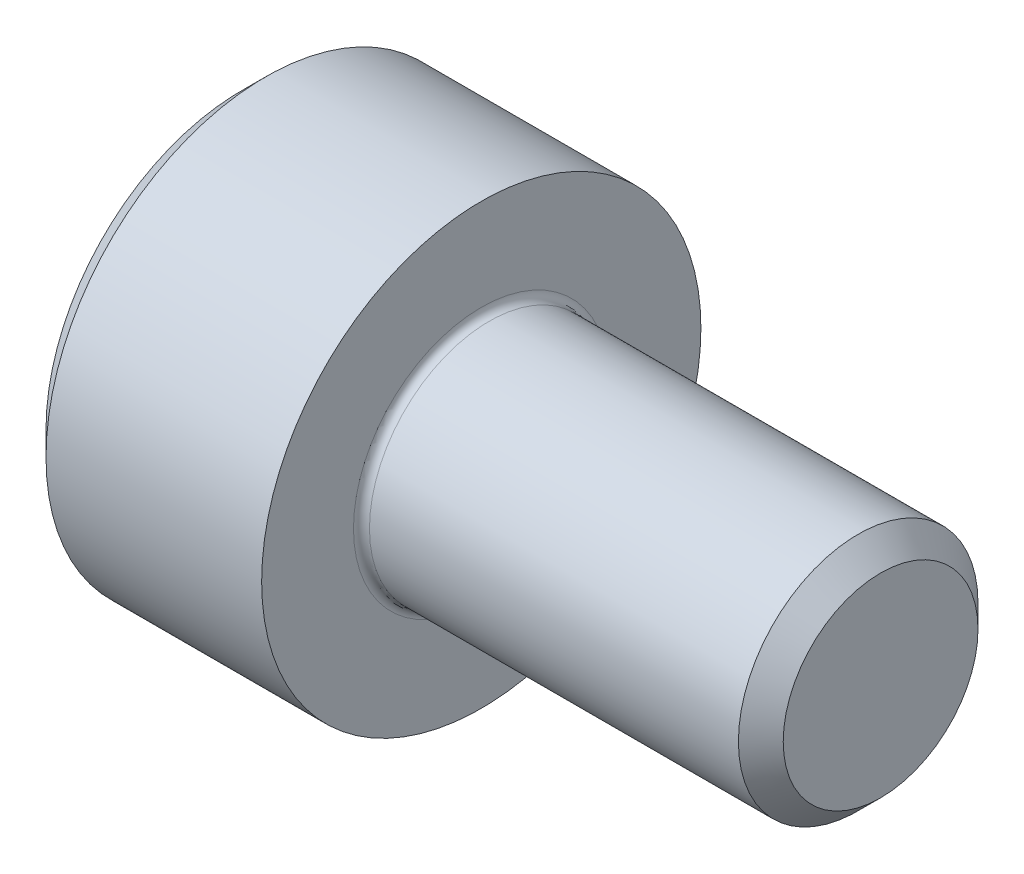
ISO-10303-21;
HEADER;
FILE_DESCRIPTION(('STEP AP214'),'2;1');
FILE_NAME('part.step','',(''),(''),'','','');
FILE_SCHEMA(('AUTOMOTIVE_DESIGN { 1 0 10303 214 1 1 1 1 }'));
ENDSEC;
DATA;
#1=APPLICATION_CONTEXT('core data for automotive mechanical design processes');
#2=APPLICATION_PROTOCOL_DEFINITION('international standard','automotive_design',2000,#1);
#3=PRODUCT_CONTEXT('',#1,'mechanical');
#4=PRODUCT('Part','Part','',(#3));
#5=PRODUCT_RELATED_PRODUCT_CATEGORY('part','',(#4));
#6=PRODUCT_DEFINITION_FORMATION('','',#4);
#7=PRODUCT_DEFINITION_CONTEXT('part definition',#1,'design');
#8=PRODUCT_DEFINITION('design','',#6,#7);
#9=PRODUCT_DEFINITION_SHAPE('','',#8);
#10=(LENGTH_UNIT() NAMED_UNIT(*) SI_UNIT(.MILLI.,.METRE.));
#11=(NAMED_UNIT(*) PLANE_ANGLE_UNIT() SI_UNIT($,.RADIAN.));
#12=(NAMED_UNIT(*) SI_UNIT($,.STERADIAN.) SOLID_ANGLE_UNIT());
#13=UNCERTAINTY_MEASURE_WITH_UNIT(LENGTH_MEASURE(1.E-05),#10,'distance_accuracy_value','');
#14=(GEOMETRIC_REPRESENTATION_CONTEXT(3) GLOBAL_UNCERTAINTY_ASSIGNED_CONTEXT((#13)) GLOBAL_UNIT_ASSIGNED_CONTEXT((#10,
#11,#12)) REPRESENTATION_CONTEXT('',''));
#15=CARTESIAN_POINT('',(0.,0.,0.));
#16=DIRECTION('',(0.,0.,1.));
#17=DIRECTION('',(1.,0.,0.));
#18=AXIS2_PLACEMENT_3D('',#15,#16,#17);
#19=CARTESIAN_POINT('',(0.,0.,0.));
#20=DIRECTION('',(-1.,0.,0.));
#21=DIRECTION('',(0.,0.,1.));
#22=AXIS2_PLACEMENT_3D('',#19,#20,#21);
#23=PLANE('',#22);
#24=DIRECTION('',(0.,-0.5,0.86602540378444));
#25=VECTOR('',#24,1.);
#26=CARTESIAN_POINT('',(0.,1.47801668912544,0.));
#27=LINE('',#26,#25);
#28=CARTESIAN_POINT('',(0.,1.47801668912544,0.));
#29=VERTEX_POINT('',#28);
#30=CARTESIAN_POINT('',(0.,0.73900834456272,1.28));
#31=VERTEX_POINT('',#30);
#32=EDGE_CURVE('E377',#29,#31,#27,.T.);
#33=ORIENTED_EDGE('',*,*,#32,.T.);
#34=DIRECTION('',(0.,1.,0.));
#35=VECTOR('',#34,1.);
#36=CARTESIAN_POINT('',(0.,-0.739008344562722,1.28));
#37=LINE('',#36,#35);
#38=CARTESIAN_POINT('',(0.,-0.739008344562722,1.28));
#39=VERTEX_POINT('',#38);
#40=EDGE_CURVE('E109',#39,#31,#37,.T.);
#41=ORIENTED_EDGE('',*,*,#40,.F.);
#42=DIRECTION('',(0.,-0.5,-0.866025403784438));
#43=VECTOR('',#42,1.);
#44=CARTESIAN_POINT('',(0.,-0.739008344562722,1.28));
#45=LINE('',#44,#43);
#46=CARTESIAN_POINT('',(0.,-1.47801668912544,0.));
#47=VERTEX_POINT('',#46);
#48=EDGE_CURVE('E380',#39,#47,#45,.T.);
#49=ORIENTED_EDGE('',*,*,#48,.T.);
#50=DIRECTION('',(0.,0.5,-0.86602540378444));
#51=VECTOR('',#50,1.);
#52=CARTESIAN_POINT('',(0.,-1.47801668912544,0.));
#53=LINE('',#52,#51);
#54=CARTESIAN_POINT('',(0.,-0.739008344562726,-1.28));
#55=VERTEX_POINT('',#54);
#56=EDGE_CURVE('E383',#47,#55,#53,.T.);
#57=ORIENTED_EDGE('',*,*,#56,.T.);
#58=DIRECTION('',(0.,-1.,0.));
#59=VECTOR('',#58,1.);
#60=CARTESIAN_POINT('',(0.,0.739008344562716,-1.28));
#61=LINE('',#60,#59);
#62=CARTESIAN_POINT('',(0.,0.739008344562716,-1.28));
#63=VERTEX_POINT('',#62);
#64=EDGE_CURVE('E386',#63,#55,#61,.T.);
#65=ORIENTED_EDGE('',*,*,#64,.F.);
#66=DIRECTION('',(0.,-0.5,-0.866025403784438));
#67=VECTOR('',#66,1.);
#68=CARTESIAN_POINT('',(0.,1.47801668912544,0.));
#69=LINE('',#68,#67);
#70=EDGE_CURVE('E104',#29,#63,#69,.T.);
#71=ORIENTED_EDGE('',*,*,#70,.F.);
#72=EDGE_LOOP('',(#33,#41,#49,#57,#65,#71));
#73=FACE_BOUND('',#72,.T.);
#74=CARTESIAN_POINT('',(0.,0.,0.));
#75=DIRECTION('',(-1.,0.,0.));
#76=DIRECTION('',(0.,0.,1.));
#77=AXIS2_PLACEMENT_3D('',#74,#75,#76);
#78=CIRCLE('',#77,2.45);
#79=CARTESIAN_POINT('',(0.,0.,2.45));
#80=VERTEX_POINT('',#79);
#81=EDGE_CURVE('E120',#80,#80,#78,.T.);
#82=ORIENTED_EDGE('',*,*,#81,.T.);
#83=EDGE_LOOP('',(#82));
#84=FACE_BOUND('',#83,.T.);
#85=ADVANCED_FACE('F17',(#73,#84),#23,.T.);
#86=CARTESIAN_POINT('',(8.,1.2195,0.));
#87=DIRECTION('',(1.,0.,0.));
#88=DIRECTION('',(0.,0.,-1.));
#89=AXIS2_PLACEMENT_3D('',#86,#87,#88);
#90=PLANE('',#89);
#91=CARTESIAN_POINT('',(8.,0.,0.));
#92=DIRECTION('',(-1.,0.,0.));
#93=DIRECTION('',(0.,0.,1.));
#94=AXIS2_PLACEMENT_3D('',#91,#92,#93);
#95=CIRCLE('',#94,1.2195);
#96=CARTESIAN_POINT('',(8.,0.,1.2195));
#97=VERTEX_POINT('',#96);
#98=EDGE_CURVE('E133',#97,#97,#95,.T.);
#99=ORIENTED_EDGE('',*,*,#98,.F.);
#100=EDGE_LOOP('',(#99));
#101=FACE_BOUND('',#100,.T.);
#102=ADVANCED_FACE('F156',(#101),#90,.T.);
#103=CARTESIAN_POINT('',(8.,0.,0.));
#104=DIRECTION('',(-1.,0.,0.));
#105=DIRECTION('',(0.,0.,1.));
#106=AXIS2_PLACEMENT_3D('',#103,#104,#105);
#107=CONICAL_SURFACE('',#106,1.2195,0.785398163397391);
#108=CARTESIAN_POINT('',(7.7195,0.,0.));
#109=DIRECTION('',(-1.,0.,0.));
#110=DIRECTION('',(0.,0.,1.));
#111=AXIS2_PLACEMENT_3D('',#108,#109,#110);
#112=CIRCLE('',#111,1.49999999999998);
#113=CARTESIAN_POINT('',(7.7195,0.,1.49999999999998));
#114=VERTEX_POINT('',#113);
#115=EDGE_CURVE('E130',#114,#114,#112,.T.);
#116=ORIENTED_EDGE('',*,*,#115,.F.);
#117=EDGE_LOOP('',(#116));
#118=FACE_BOUND('',#117,.T.);
#119=ORIENTED_EDGE('',*,*,#98,.T.);
#120=EDGE_LOOP('',(#119));
#121=FACE_BOUND('',#120,.T.);
#122=ADVANCED_FACE('F163',(#118,#121),#107,.T.);
#123=CARTESIAN_POINT('',(-31.75,0.,0.));
#124=DIRECTION('',(-1.,0.,0.));
#125=DIRECTION('',(0.,0.,1.));
#126=AXIS2_PLACEMENT_3D('',#123,#124,#125);
#127=CYLINDRICAL_SURFACE('',#126,1.5);
#128=CARTESIAN_POINT('',(3.1,0.,0.));
#129=DIRECTION('',(1.,0.,0.));
#130=DIRECTION('',(0.,0.,-1.));
#131=AXIS2_PLACEMENT_3D('',#128,#129,#130);
#132=CIRCLE('',#131,1.5);
#133=CARTESIAN_POINT('',(3.1,0.,-1.5));
#134=VERTEX_POINT('',#133);
#135=EDGE_CURVE('E11',#134,#134,#132,.T.);
#136=ORIENTED_EDGE('',*,*,#135,.T.);
#137=EDGE_LOOP('',(#136));
#138=FACE_BOUND('',#137,.T.);
#139=ORIENTED_EDGE('',*,*,#115,.T.);
#140=EDGE_LOOP('',(#139));
#141=FACE_BOUND('',#140,.T.);
#142=ADVANCED_FACE('F174',(#138,#141),#127,.T.);
#143=CARTESIAN_POINT('',(3.,2.75,0.));
#144=DIRECTION('',(1.,0.,0.));
#145=DIRECTION('',(0.,0.,-1.));
#146=AXIS2_PLACEMENT_3D('',#143,#144,#145);
#147=PLANE('',#146);
#148=CARTESIAN_POINT('',(3.,0.,0.));
#149=DIRECTION('',(1.,0.,0.));
#150=DIRECTION('',(0.,0.,-1.));
#151=AXIS2_PLACEMENT_3D('',#148,#149,#150);
#152=CIRCLE('',#151,1.6);
#153=CARTESIAN_POINT('',(3.,0.,-1.6));
#154=VERTEX_POINT('',#153);
#155=EDGE_CURVE('E25',#154,#154,#152,.F.);
#156=ORIENTED_EDGE('',*,*,#155,.T.);
#157=EDGE_LOOP('',(#156));
#158=FACE_BOUND('',#157,.T.);
#159=CARTESIAN_POINT('',(3.,0.,0.));
#160=DIRECTION('',(-1.,0.,0.));
#161=DIRECTION('',(0.,0.,1.));
#162=AXIS2_PLACEMENT_3D('',#159,#160,#161);
#163=CIRCLE('',#162,2.75);
#164=CARTESIAN_POINT('',(3.,0.,2.75));
#165=VERTEX_POINT('',#164);
#166=EDGE_CURVE('E127',#165,#165,#163,.T.);
#167=ORIENTED_EDGE('',*,*,#166,.F.);
#168=EDGE_LOOP('',(#167));
#169=FACE_BOUND('',#168,.T.);
#170=ADVANCED_FACE('F138',(#158,#169),#147,.T.);
#171=CARTESIAN_POINT('',(-31.75,0.,0.));
#172=DIRECTION('',(-1.,0.,0.));
#173=DIRECTION('',(0.,0.,1.));
#174=AXIS2_PLACEMENT_3D('',#171,#172,#173);
#175=CYLINDRICAL_SURFACE('',#174,2.75);
#176=ORIENTED_EDGE('',*,*,#166,.T.);
#177=EDGE_LOOP('',(#176));
#178=FACE_BOUND('',#177,.T.);
#179=CARTESIAN_POINT('',(0.3,0.,0.));
#180=DIRECTION('',(-1.,0.,0.));
#181=DIRECTION('',(0.,0.,1.));
#182=AXIS2_PLACEMENT_3D('',#179,#180,#181);
#183=CIRCLE('',#182,2.75);
#184=CARTESIAN_POINT('',(0.3,0.,2.75));
#185=VERTEX_POINT('',#184);
#186=EDGE_CURVE('E124',#185,#185,#183,.T.);
#187=ORIENTED_EDGE('',*,*,#186,.F.);
#188=EDGE_LOOP('',(#187));
#189=FACE_BOUND('',#188,.T.);
#190=ADVANCED_FACE('F151',(#178,#189),#175,.T.);
#191=CARTESIAN_POINT('',(0.,0.,0.));
#192=DIRECTION('',(1.,0.,0.));
#193=DIRECTION('',(0.,0.,-1.));
#194=AXIS2_PLACEMENT_3D('',#191,#192,#193);
#195=CONICAL_SURFACE('',#194,2.45,0.785398163397439);
#196=ORIENTED_EDGE('',*,*,#186,.T.);
#197=EDGE_LOOP('',(#196));
#198=FACE_BOUND('',#197,.T.);
#199=ORIENTED_EDGE('',*,*,#81,.F.);
#200=EDGE_LOOP('',(#199));
#201=FACE_BOUND('',#200,.T.);
#202=ADVANCED_FACE('F142',(#198,#201),#195,.T.);
#203=CARTESIAN_POINT('',(3.1,0.,0.));
#204=DIRECTION('',(1.,0.,0.));
#205=DIRECTION('',(0.,0.,-1.));
#206=AXIS2_PLACEMENT_3D('',#203,#204,#205);
#207=TOROIDAL_SURFACE('',#206,1.6,0.1);
#208=ORIENTED_EDGE('',*,*,#135,.F.);
#209=EDGE_LOOP('',(#208));
#210=FACE_BOUND('',#209,.T.);
#211=ORIENTED_EDGE('',*,*,#155,.F.);
#212=EDGE_LOOP('',(#211));
#213=FACE_BOUND('',#212,.T.);
#214=ADVANCED_FACE('F19',(#210,#213),#207,.F.);
#215=CARTESIAN_POINT('',(1.3,1.47801668912544,0.));
#216=DIRECTION('',(0.,-0.86602540378444,-0.5));
#217=DIRECTION('',(0.,0.5,-0.86602540378444));
#218=AXIS2_PLACEMENT_3D('',#215,#216,#217);
#219=PLANE('',#218);
#220=ORIENTED_EDGE('',*,*,#32,.F.);
#221=DIRECTION('',(-1.,0.,0.));
#222=VECTOR('',#221,1.);
#223=CARTESIAN_POINT('',(1.3,1.47801668912544,0.));
#224=LINE('',#223,#222);
#225=CARTESIAN_POINT('',(1.3,1.47801668912544,0.));
#226=VERTEX_POINT('',#225);
#227=EDGE_CURVE('E376',#226,#29,#224,.T.);
#228=ORIENTED_EDGE('',*,*,#227,.F.);
#229=DIRECTION('',(0.,-0.5,0.86602540378444));
#230=VECTOR('',#229,1.);
#231=CARTESIAN_POINT('',(1.3,1.47801668912544,0.));
#232=LINE('',#231,#230);
#233=CARTESIAN_POINT('',(1.3,1.10851251684408,0.64));
#234=VERTEX_POINT('',#233);
#235=EDGE_CURVE('E32',#226,#234,#232,.T.);
#236=ORIENTED_EDGE('',*,*,#235,.T.);
#237=CARTESIAN_POINT('',(1.3,0.73900834456272,1.28));
#238=VERTEX_POINT('',#237);
#239=EDGE_CURVE('E90',#234,#238,#232,.T.);
#240=ORIENTED_EDGE('',*,*,#239,.T.);
#241=DIRECTION('',(-1.,0.,0.));
#242=VECTOR('',#241,1.);
#243=CARTESIAN_POINT('',(1.3,0.73900834456272,1.28));
#244=LINE('',#243,#242);
#245=EDGE_CURVE('E102',#238,#31,#244,.T.);
#246=ORIENTED_EDGE('',*,*,#245,.T.);
#247=EDGE_LOOP('',(#220,#228,#236,#240,#246));
#248=FACE_BOUND('',#247,.T.);
#249=ADVANCED_FACE('F101',(#248),#219,.T.);
#250=CARTESIAN_POINT('',(1.3,-0.739008344562722,1.28));
#251=DIRECTION('',(0.,0.,1.));
#252=DIRECTION('',(0.,-1.,0.));
#253=AXIS2_PLACEMENT_3D('',#250,#251,#252);
#254=PLANE('',#253);
#255=ORIENTED_EDGE('',*,*,#40,.T.);
#256=ORIENTED_EDGE('',*,*,#245,.F.);
#257=DIRECTION('',(0.,1.,0.));
#258=VECTOR('',#257,1.);
#259=CARTESIAN_POINT('',(1.3,-0.739008344562722,1.28));
#260=LINE('',#259,#258);
#261=CARTESIAN_POINT('',(1.3,0.,1.28));
#262=VERTEX_POINT('',#261);
#263=EDGE_CURVE('E88',#262,#238,#260,.T.);
#264=ORIENTED_EDGE('',*,*,#263,.F.);
#265=CARTESIAN_POINT('',(1.3,-0.739008344562722,1.28));
#266=VERTEX_POINT('',#265);
#267=EDGE_CURVE('E98',#266,#262,#260,.T.);
#268=ORIENTED_EDGE('',*,*,#267,.F.);
#269=DIRECTION('',(-1.,0.,0.));
#270=VECTOR('',#269,1.);
#271=CARTESIAN_POINT('',(1.3,-0.739008344562722,1.28));
#272=LINE('',#271,#270);
#273=EDGE_CURVE('E111',#266,#39,#272,.T.);
#274=ORIENTED_EDGE('',*,*,#273,.T.);
#275=EDGE_LOOP('',(#255,#256,#264,#268,#274));
#276=FACE_BOUND('',#275,.T.);
#277=ADVANCED_FACE('F106',(#276),#254,.F.);
#278=CARTESIAN_POINT('',(1.3,-0.739008344562722,1.28));
#279=DIRECTION('',(0.,0.866025403784438,-0.5));
#280=DIRECTION('',(0.,0.5,0.866025403784438));
#281=AXIS2_PLACEMENT_3D('',#278,#279,#280);
#282=PLANE('',#281);
#283=ORIENTED_EDGE('',*,*,#48,.F.);
#284=ORIENTED_EDGE('',*,*,#273,.F.);
#285=DIRECTION('',(0.,-0.5,-0.866025403784438));
#286=VECTOR('',#285,1.);
#287=CARTESIAN_POINT('',(1.3,-0.739008344562722,1.28));
#288=LINE('',#287,#286);
#289=CARTESIAN_POINT('',(1.3,-1.10851251684408,0.64));
#290=VERTEX_POINT('',#289);
#291=EDGE_CURVE('E355',#266,#290,#288,.T.);
#292=ORIENTED_EDGE('',*,*,#291,.T.);
#293=CARTESIAN_POINT('',(1.3,-1.47801668912544,0.));
#294=VERTEX_POINT('',#293);
#295=EDGE_CURVE('E357',#290,#294,#288,.T.);
#296=ORIENTED_EDGE('',*,*,#295,.T.);
#297=DIRECTION('',(-1.,0.,0.));
#298=VECTOR('',#297,1.);
#299=CARTESIAN_POINT('',(1.3,-1.47801668912544,0.));
#300=LINE('',#299,#298);
#301=EDGE_CURVE('E116',#294,#47,#300,.T.);
#302=ORIENTED_EDGE('',*,*,#301,.T.);
#303=EDGE_LOOP('',(#283,#284,#292,#296,#302));
#304=FACE_BOUND('',#303,.T.);
#305=ADVANCED_FACE('F233',(#304),#282,.T.);
#306=CARTESIAN_POINT('',(1.3,-1.47801668912544,0.));
#307=DIRECTION('',(0.,0.86602540378444,0.5));
#308=DIRECTION('',(0.,-0.5,0.86602540378444));
#309=AXIS2_PLACEMENT_3D('',#306,#307,#308);
#310=PLANE('',#309);
#311=ORIENTED_EDGE('',*,*,#56,.F.);
#312=ORIENTED_EDGE('',*,*,#301,.F.);
#313=DIRECTION('',(0.,0.5,-0.86602540378444));
#314=VECTOR('',#313,1.);
#315=CARTESIAN_POINT('',(1.3,-1.47801668912544,0.));
#316=LINE('',#315,#314);
#317=CARTESIAN_POINT('',(1.3,-1.10851251684409,-0.64));
#318=VERTEX_POINT('',#317);
#319=EDGE_CURVE('E360',#294,#318,#316,.T.);
#320=ORIENTED_EDGE('',*,*,#319,.T.);
#321=CARTESIAN_POINT('',(1.3,-0.739008344562726,-1.28));
#322=VERTEX_POINT('',#321);
#323=EDGE_CURVE('E364',#318,#322,#316,.T.);
#324=ORIENTED_EDGE('',*,*,#323,.T.);
#325=DIRECTION('',(-1.,0.,0.));
#326=VECTOR('',#325,1.);
#327=CARTESIAN_POINT('',(1.3,-0.739008344562726,-1.28));
#328=LINE('',#327,#326);
#329=EDGE_CURVE('E395',#322,#55,#328,.T.);
#330=ORIENTED_EDGE('',*,*,#329,.T.);
#331=EDGE_LOOP('',(#311,#312,#320,#324,#330));
#332=FACE_BOUND('',#331,.T.);
#333=ADVANCED_FACE('F243',(#332),#310,.T.);
#334=CARTESIAN_POINT('',(1.3,0.739008344562716,-1.28));
#335=DIRECTION('',(0.,0.,-1.));
#336=DIRECTION('',(0.,1.,0.));
#337=AXIS2_PLACEMENT_3D('',#334,#335,#336);
#338=PLANE('',#337);
#339=ORIENTED_EDGE('',*,*,#64,.T.);
#340=ORIENTED_EDGE('',*,*,#329,.F.);
#341=DIRECTION('',(0.,-1.,0.));
#342=VECTOR('',#341,1.);
#343=CARTESIAN_POINT('',(1.3,0.739008344562716,-1.28));
#344=LINE('',#343,#342);
#345=CARTESIAN_POINT('',(1.3,0.,-1.28));
#346=VERTEX_POINT('',#345);
#347=EDGE_CURVE('E368',#346,#322,#344,.T.);
#348=ORIENTED_EDGE('',*,*,#347,.F.);
#349=CARTESIAN_POINT('',(1.3,0.739008344562716,-1.28));
#350=VERTEX_POINT('',#349);
#351=EDGE_CURVE('E369',#350,#346,#344,.T.);
#352=ORIENTED_EDGE('',*,*,#351,.F.);
#353=DIRECTION('',(-1.,0.,0.));
#354=VECTOR('',#353,1.);
#355=CARTESIAN_POINT('',(1.3,0.739008344562716,-1.28));
#356=LINE('',#355,#354);
#357=EDGE_CURVE('E392',#350,#63,#356,.T.);
#358=ORIENTED_EDGE('',*,*,#357,.T.);
#359=EDGE_LOOP('',(#339,#340,#348,#352,#358));
#360=FACE_BOUND('',#359,.T.);
#361=ADVANCED_FACE('F253',(#360),#338,.F.);
#362=CARTESIAN_POINT('',(1.3,1.47801668912544,0.));
#363=DIRECTION('',(0.,0.866025403784438,-0.5));
#364=DIRECTION('',(0.,0.5,0.866025403784438));
#365=AXIS2_PLACEMENT_3D('',#362,#363,#364);
#366=PLANE('',#365);
#367=ORIENTED_EDGE('',*,*,#70,.T.);
#368=ORIENTED_EDGE('',*,*,#357,.F.);
#369=DIRECTION('',(0.,-0.5,-0.866025403784438));
#370=VECTOR('',#369,1.);
#371=CARTESIAN_POINT('',(1.3,1.47801668912544,0.));
#372=LINE('',#371,#370);
#373=CARTESIAN_POINT('',(1.3,1.10851251684408,-0.64));
#374=VERTEX_POINT('',#373);
#375=EDGE_CURVE('E372',#374,#350,#372,.T.);
#376=ORIENTED_EDGE('',*,*,#375,.F.);
#377=EDGE_CURVE('E373',#226,#374,#372,.T.);
#378=ORIENTED_EDGE('',*,*,#377,.F.);
#379=ORIENTED_EDGE('',*,*,#227,.T.);
#380=EDGE_LOOP('',(#367,#368,#376,#378,#379));
#381=FACE_BOUND('',#380,.T.);
#382=ADVANCED_FACE('F263',(#381),#366,.F.);
#383=CARTESIAN_POINT('',(1.3,0.73900834456272,1.28));
#384=DIRECTION('',(-1.,0.,0.));
#385=DIRECTION('',(0.,0.,1.));
#386=AXIS2_PLACEMENT_3D('',#383,#384,#385);
#387=PLANE('',#386);
#388=CARTESIAN_POINT('',(1.3,0.,0.));
#389=DIRECTION('',(-1.,0.,0.));
#390=DIRECTION('',(0.,0.,1.));
#391=AXIS2_PLACEMENT_3D('',#388,#389,#390);
#392=CIRCLE('',#391,1.28);
#393=EDGE_CURVE('E110',#290,#262,#392,.T.);
#394=ORIENTED_EDGE('',*,*,#393,.F.);
#395=ORIENTED_EDGE('',*,*,#291,.F.);
#396=ORIENTED_EDGE('',*,*,#267,.T.);
#397=EDGE_LOOP('',(#394,#395,#396));
#398=FACE_BOUND('',#397,.T.);
#399=ADVANCED_FACE('F273',(#398),#387,.T.);
#400=EDGE_CURVE('E114',#318,#290,#392,.T.);
#401=ORIENTED_EDGE('',*,*,#400,.F.);
#402=ORIENTED_EDGE('',*,*,#319,.F.);
#403=ORIENTED_EDGE('',*,*,#295,.F.);
#404=EDGE_LOOP('',(#401,#402,#403));
#405=FACE_BOUND('',#404,.T.);
#406=ADVANCED_FACE('F283',(#405),#387,.T.);
#407=EDGE_CURVE('E403',#346,#318,#392,.T.);
#408=ORIENTED_EDGE('',*,*,#407,.F.);
#409=ORIENTED_EDGE('',*,*,#347,.T.);
#410=ORIENTED_EDGE('',*,*,#323,.F.);
#411=EDGE_LOOP('',(#408,#409,#410));
#412=FACE_BOUND('',#411,.T.);
#413=ADVANCED_FACE('F293',(#412),#387,.T.);
#414=EDGE_CURVE('E402',#374,#346,#392,.T.);
#415=ORIENTED_EDGE('',*,*,#414,.F.);
#416=ORIENTED_EDGE('',*,*,#375,.T.);
#417=ORIENTED_EDGE('',*,*,#351,.T.);
#418=EDGE_LOOP('',(#415,#416,#417));
#419=FACE_BOUND('',#418,.T.);
#420=ADVANCED_FACE('F302',(#419),#387,.T.);
#421=EDGE_CURVE('E121',#234,#374,#392,.T.);
#422=ORIENTED_EDGE('',*,*,#421,.F.);
#423=ORIENTED_EDGE('',*,*,#235,.F.);
#424=ORIENTED_EDGE('',*,*,#377,.T.);
#425=EDGE_LOOP('',(#422,#423,#424));
#426=FACE_BOUND('',#425,.T.);
#427=ADVANCED_FACE('F311',(#426),#387,.T.);
#428=EDGE_CURVE('E93',#262,#234,#392,.T.);
#429=ORIENTED_EDGE('',*,*,#428,.F.);
#430=ORIENTED_EDGE('',*,*,#263,.T.);
#431=ORIENTED_EDGE('',*,*,#239,.F.);
#432=EDGE_LOOP('',(#429,#430,#431));
#433=FACE_BOUND('',#432,.T.);
#434=ADVANCED_FACE('F89',(#433),#387,.T.);
#435=CARTESIAN_POINT('',(1.3,0.,0.));
#436=DIRECTION('',(-1.,0.,0.));
#437=DIRECTION('',(0.,0.,1.));
#438=AXIS2_PLACEMENT_3D('',#435,#436,#437);
#439=CONICAL_SURFACE('',#438,1.28,1.0471975511966);
#440=CARTESIAN_POINT('',(2.03900834456273,0.,0.));
#441=VERTEX_POINT('',#440);
#442=VERTEX_LOOP('',#441);
#443=FACE_BOUND('',#442,.T.);
#444=ORIENTED_EDGE('',*,*,#428,.T.);
#445=ORIENTED_EDGE('',*,*,#421,.T.);
#446=ORIENTED_EDGE('',*,*,#414,.T.);
#447=ORIENTED_EDGE('',*,*,#407,.T.);
#448=ORIENTED_EDGE('',*,*,#400,.T.);
#449=ORIENTED_EDGE('',*,*,#393,.T.);
#450=EDGE_LOOP('',(#444,#445,#446,#447,#448,#449));
#451=FACE_BOUND('',#450,.T.);
#452=ADVANCED_FACE('F167',(#443,#451),#439,.F.);
#453=CLOSED_SHELL('',(#85,#102,#122,#142,#170,#190,#202,#214,#249,#277,#305,#333,#361,#382,#399,
#406,#413,#420,#427,#434,#452));
#454=MANIFOLD_SOLID_BREP('B1',#453);
#455=ADVANCED_BREP_SHAPE_REPRESENTATION('',(#18,#454),#14);
#456=SHAPE_DEFINITION_REPRESENTATION(#9,#455);
ENDSEC;
END-ISO-10303-21;
